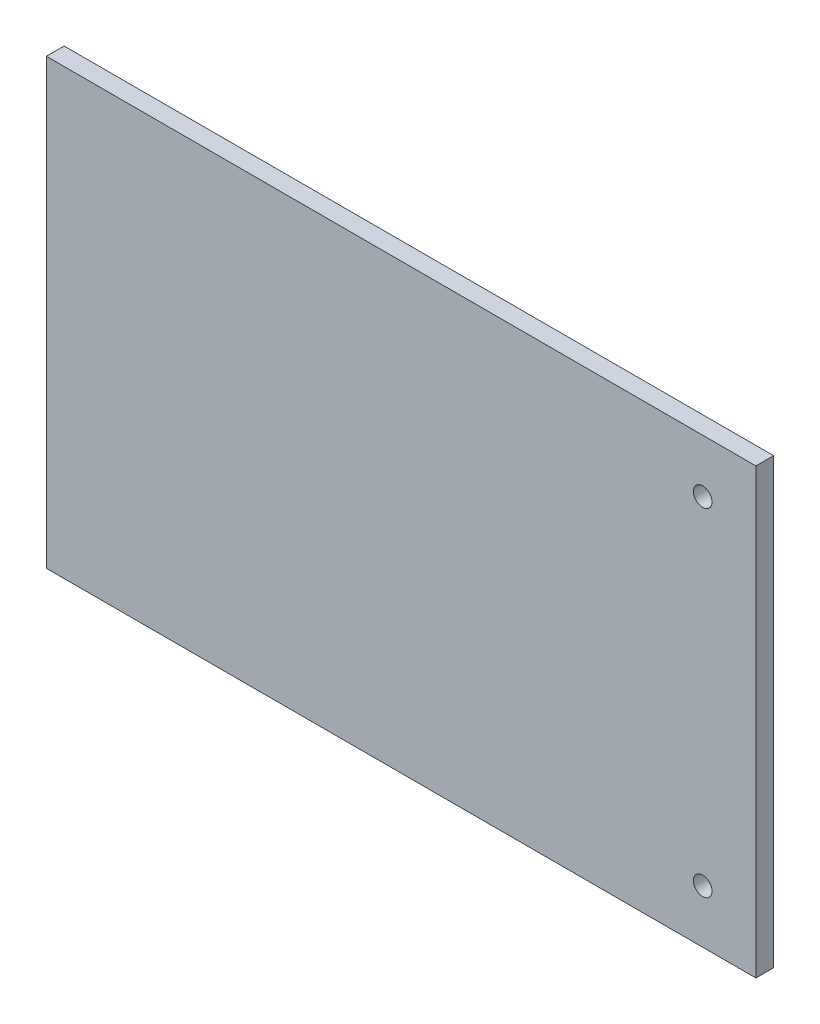
ISO-10303-21;
HEADER;
FILE_DESCRIPTION(('STEP AP214'),'2;1');
FILE_NAME('part.step','',(''),(''),'','','');
FILE_SCHEMA(('AUTOMOTIVE_DESIGN { 1 0 10303 214 1 1 1 1 }'));
ENDSEC;
DATA;
#1=APPLICATION_CONTEXT('core data for automotive mechanical design processes');
#2=APPLICATION_PROTOCOL_DEFINITION('international standard','automotive_design',2000,#1);
#3=PRODUCT_CONTEXT('',#1,'mechanical');
#4=PRODUCT('Part','Part','',(#3));
#5=PRODUCT_RELATED_PRODUCT_CATEGORY('part','',(#4));
#6=PRODUCT_DEFINITION_FORMATION('','',#4);
#7=PRODUCT_DEFINITION_CONTEXT('part definition',#1,'design');
#8=PRODUCT_DEFINITION('design','',#6,#7);
#9=PRODUCT_DEFINITION_SHAPE('','',#8);
#10=(LENGTH_UNIT() NAMED_UNIT(*) SI_UNIT(.MILLI.,.METRE.));
#11=(NAMED_UNIT(*) PLANE_ANGLE_UNIT() SI_UNIT($,.RADIAN.));
#12=(NAMED_UNIT(*) SI_UNIT($,.STERADIAN.) SOLID_ANGLE_UNIT());
#13=UNCERTAINTY_MEASURE_WITH_UNIT(LENGTH_MEASURE(1.E-05),#10,'distance_accuracy_value','');
#14=(GEOMETRIC_REPRESENTATION_CONTEXT(3) GLOBAL_UNCERTAINTY_ASSIGNED_CONTEXT((#13)) GLOBAL_UNIT_ASSIGNED_CONTEXT((#10,
#11,#12)) REPRESENTATION_CONTEXT('',''));
#15=CARTESIAN_POINT('',(0.,0.,0.));
#16=DIRECTION('',(0.,0.,1.));
#17=DIRECTION('',(1.,0.,0.));
#18=AXIS2_PLACEMENT_3D('',#15,#16,#17);
#19=CARTESIAN_POINT('',(-200.,125.,10.));
#20=DIRECTION('',(1.,0.,0.));
#21=DIRECTION('',(0.,1.,0.));
#22=AXIS2_PLACEMENT_3D('',#19,#20,#21);
#23=PLANE('',#22);
#24=DIRECTION('',(0.,-1.,0.));
#25=VECTOR('',#24,1.);
#26=CARTESIAN_POINT('',(-200.,125.,0.));
#27=LINE('',#26,#25);
#28=CARTESIAN_POINT('',(-200.,125.,0.));
#29=VERTEX_POINT('',#28);
#30=CARTESIAN_POINT('',(-200.,-125.,0.));
#31=VERTEX_POINT('',#30);
#32=EDGE_CURVE('E106',#29,#31,#27,.T.);
#33=ORIENTED_EDGE('',*,*,#32,.T.);
#34=DIRECTION('',(0.,0.,-1.));
#35=VECTOR('',#34,1.);
#36=CARTESIAN_POINT('',(-200.,-125.,10.));
#37=LINE('',#36,#35);
#38=CARTESIAN_POINT('',(-200.,-125.,10.));
#39=VERTEX_POINT('',#38);
#40=EDGE_CURVE('E11',#39,#31,#37,.T.);
#41=ORIENTED_EDGE('',*,*,#40,.F.);
#42=DIRECTION('',(0.,-1.,0.));
#43=VECTOR('',#42,1.);
#44=CARTESIAN_POINT('',(-200.,125.,10.));
#45=LINE('',#44,#43);
#46=CARTESIAN_POINT('',(-200.,125.,10.));
#47=VERTEX_POINT('',#46);
#48=EDGE_CURVE('E90',#47,#39,#45,.T.);
#49=ORIENTED_EDGE('',*,*,#48,.F.);
#50=DIRECTION('',(0.,0.,-1.));
#51=VECTOR('',#50,1.);
#52=CARTESIAN_POINT('',(-200.,125.,10.));
#53=LINE('',#52,#51);
#54=EDGE_CURVE('E102',#47,#29,#53,.T.);
#55=ORIENTED_EDGE('',*,*,#54,.T.);
#56=EDGE_LOOP('',(#33,#41,#49,#55));
#57=FACE_BOUND('',#56,.T.);
#58=ADVANCED_FACE('F38',(#57),#23,.F.);
#59=CARTESIAN_POINT('',(200.,-125.,10.));
#60=DIRECTION('',(0.,1.,0.));
#61=DIRECTION('',(-1.,0.,0.));
#62=AXIS2_PLACEMENT_3D('',#59,#60,#61);
#63=PLANE('',#62);
#64=DIRECTION('',(1.,0.,0.));
#65=VECTOR('',#64,1.);
#66=CARTESIAN_POINT('',(200.,-125.,0.));
#67=LINE('',#66,#65);
#68=CARTESIAN_POINT('',(200.,-125.,0.));
#69=VERTEX_POINT('',#68);
#70=EDGE_CURVE('E95',#31,#69,#67,.T.);
#71=ORIENTED_EDGE('',*,*,#70,.T.);
#72=DIRECTION('',(0.,0.,-1.));
#73=VECTOR('',#72,1.);
#74=CARTESIAN_POINT('',(200.,-125.,10.));
#75=LINE('',#74,#73);
#76=CARTESIAN_POINT('',(200.,-125.,10.));
#77=VERTEX_POINT('',#76);
#78=EDGE_CURVE('E47',#77,#69,#75,.T.);
#79=ORIENTED_EDGE('',*,*,#78,.F.);
#80=DIRECTION('',(1.,0.,0.));
#81=VECTOR('',#80,1.);
#82=CARTESIAN_POINT('',(200.,-125.,10.));
#83=LINE('',#82,#81);
#84=EDGE_CURVE('E85',#39,#77,#83,.T.);
#85=ORIENTED_EDGE('',*,*,#84,.F.);
#86=ORIENTED_EDGE('',*,*,#40,.T.);
#87=EDGE_LOOP('',(#71,#79,#85,#86));
#88=FACE_BOUND('',#87,.T.);
#89=ADVANCED_FACE('F94',(#88),#63,.F.);
#90=CARTESIAN_POINT('',(200.,125.,10.));
#91=DIRECTION('',(-1.,0.,0.));
#92=DIRECTION('',(0.,0.,1.));
#93=AXIS2_PLACEMENT_3D('',#90,#91,#92);
#94=PLANE('',#93);
#95=DIRECTION('',(0.,1.,0.));
#96=VECTOR('',#95,1.);
#97=CARTESIAN_POINT('',(200.,125.,0.));
#98=LINE('',#97,#96);
#99=CARTESIAN_POINT('',(200.,125.,0.));
#100=VERTEX_POINT('',#99);
#101=EDGE_CURVE('E72',#69,#100,#98,.T.);
#102=ORIENTED_EDGE('',*,*,#101,.T.);
#103=DIRECTION('',(0.,0.,-1.));
#104=VECTOR('',#103,1.);
#105=CARTESIAN_POINT('',(200.,125.,10.));
#106=LINE('',#105,#104);
#107=CARTESIAN_POINT('',(200.,125.,10.));
#108=VERTEX_POINT('',#107);
#109=EDGE_CURVE('E97',#108,#100,#106,.T.);
#110=ORIENTED_EDGE('',*,*,#109,.F.);
#111=DIRECTION('',(0.,1.,0.));
#112=VECTOR('',#111,1.);
#113=CARTESIAN_POINT('',(200.,125.,10.));
#114=LINE('',#113,#112);
#115=EDGE_CURVE('E88',#77,#108,#114,.T.);
#116=ORIENTED_EDGE('',*,*,#115,.F.);
#117=ORIENTED_EDGE('',*,*,#78,.T.);
#118=EDGE_LOOP('',(#102,#110,#116,#117));
#119=FACE_BOUND('',#118,.T.);
#120=ADVANCED_FACE('F98',(#119),#94,.F.);
#121=CARTESIAN_POINT('',(200.,125.,10.));
#122=DIRECTION('',(0.,-1.,0.));
#123=DIRECTION('',(1.,0.,0.));
#124=AXIS2_PLACEMENT_3D('',#121,#122,#123);
#125=PLANE('',#124);
#126=DIRECTION('',(-1.,0.,0.));
#127=VECTOR('',#126,1.);
#128=CARTESIAN_POINT('',(200.,125.,0.));
#129=LINE('',#128,#127);
#130=EDGE_CURVE('E78',#100,#29,#129,.T.);
#131=ORIENTED_EDGE('',*,*,#130,.T.);
#132=ORIENTED_EDGE('',*,*,#54,.F.);
#133=DIRECTION('',(-1.,0.,0.));
#134=VECTOR('',#133,1.);
#135=CARTESIAN_POINT('',(200.,125.,10.));
#136=LINE('',#135,#134);
#137=EDGE_CURVE('E55',#108,#47,#136,.T.);
#138=ORIENTED_EDGE('',*,*,#137,.F.);
#139=ORIENTED_EDGE('',*,*,#109,.T.);
#140=EDGE_LOOP('',(#131,#132,#138,#139));
#141=FACE_BOUND('',#140,.T.);
#142=ADVANCED_FACE('F120',(#141),#125,.F.);
#143=CARTESIAN_POINT('',(0.,0.,10.));
#144=DIRECTION('',(0.,0.,-1.));
#145=DIRECTION('',(-1.,0.,0.));
#146=AXIS2_PLACEMENT_3D('',#143,#144,#145);
#147=PLANE('',#146);
#148=CARTESIAN_POINT('',(170.,95.,10.));
#149=DIRECTION('',(0.,0.,1.));
#150=DIRECTION('',(1.,0.,0.));
#151=AXIS2_PLACEMENT_3D('',#148,#149,#150);
#152=CIRCLE('',#151,5.25);
#153=CARTESIAN_POINT('',(175.25,95.,10.));
#154=VERTEX_POINT('',#153);
#155=EDGE_CURVE('E138',#154,#154,#152,.T.);
#156=ORIENTED_EDGE('',*,*,#155,.F.);
#157=EDGE_LOOP('',(#156));
#158=FACE_BOUND('',#157,.T.);
#159=CARTESIAN_POINT('',(170.,-95.0000000000001,10.));
#160=DIRECTION('',(0.,0.,1.));
#161=DIRECTION('',(1.,0.,0.));
#162=AXIS2_PLACEMENT_3D('',#159,#160,#161);
#163=CIRCLE('',#162,5.25);
#164=CARTESIAN_POINT('',(175.25,-95.0000000000001,10.));
#165=VERTEX_POINT('',#164);
#166=EDGE_CURVE('E130',#165,#165,#163,.T.);
#167=ORIENTED_EDGE('',*,*,#166,.F.);
#168=EDGE_LOOP('',(#167));
#169=FACE_BOUND('',#168,.T.);
#170=ORIENTED_EDGE('',*,*,#48,.T.);
#171=ORIENTED_EDGE('',*,*,#84,.T.);
#172=ORIENTED_EDGE('',*,*,#115,.T.);
#173=ORIENTED_EDGE('',*,*,#137,.T.);
#174=EDGE_LOOP('',(#170,#171,#172,#173));
#175=FACE_BOUND('',#174,.T.);
#176=ADVANCED_FACE('F86',(#158,#169,#175),#147,.F.);
#177=CARTESIAN_POINT('',(0.,0.,0.));
#178=DIRECTION('',(0.,0.,-1.));
#179=DIRECTION('',(-1.,0.,0.));
#180=AXIS2_PLACEMENT_3D('',#177,#178,#179);
#181=PLANE('',#180);
#182=CARTESIAN_POINT('',(170.,95.,0.));
#183=DIRECTION('',(0.,0.,1.));
#184=DIRECTION('',(1.,0.,0.));
#185=AXIS2_PLACEMENT_3D('',#182,#183,#184);
#186=CIRCLE('',#185,5.25);
#187=CARTESIAN_POINT('',(175.25,95.,0.));
#188=VERTEX_POINT('',#187);
#189=EDGE_CURVE('E134',#188,#188,#186,.T.);
#190=ORIENTED_EDGE('',*,*,#189,.T.);
#191=EDGE_LOOP('',(#190));
#192=FACE_BOUND('',#191,.T.);
#193=CARTESIAN_POINT('',(170.,-95.0000000000001,0.));
#194=DIRECTION('',(0.,0.,1.));
#195=DIRECTION('',(1.,0.,0.));
#196=AXIS2_PLACEMENT_3D('',#193,#194,#195);
#197=CIRCLE('',#196,5.25);
#198=CARTESIAN_POINT('',(175.25,-95.0000000000001,0.));
#199=VERTEX_POINT('',#198);
#200=EDGE_CURVE('E110',#199,#199,#197,.T.);
#201=ORIENTED_EDGE('',*,*,#200,.T.);
#202=EDGE_LOOP('',(#201));
#203=FACE_BOUND('',#202,.T.);
#204=ORIENTED_EDGE('',*,*,#32,.F.);
#205=ORIENTED_EDGE('',*,*,#130,.F.);
#206=ORIENTED_EDGE('',*,*,#101,.F.);
#207=ORIENTED_EDGE('',*,*,#70,.F.);
#208=EDGE_LOOP('',(#204,#205,#206,#207));
#209=FACE_BOUND('',#208,.T.);
#210=ADVANCED_FACE('F123',(#192,#203,#209),#181,.T.);
#211=CARTESIAN_POINT('',(170.,-95.0000000000001,10.));
#212=DIRECTION('',(0.,0.,1.));
#213=DIRECTION('',(1.,0.,0.));
#214=AXIS2_PLACEMENT_3D('',#211,#212,#213);
#215=CYLINDRICAL_SURFACE('',#214,5.25);
#216=ORIENTED_EDGE('',*,*,#200,.F.);
#217=EDGE_LOOP('',(#216));
#218=FACE_BOUND('',#217,.T.);
#219=ORIENTED_EDGE('',*,*,#166,.T.);
#220=EDGE_LOOP('',(#219));
#221=FACE_BOUND('',#220,.T.);
#222=ADVANCED_FACE('F150',(#218,#221),#215,.F.);
#223=CARTESIAN_POINT('',(170.,95.,10.));
#224=DIRECTION('',(0.,0.,1.));
#225=DIRECTION('',(1.,0.,0.));
#226=AXIS2_PLACEMENT_3D('',#223,#224,#225);
#227=CYLINDRICAL_SURFACE('',#226,5.25);
#228=ORIENTED_EDGE('',*,*,#189,.F.);
#229=EDGE_LOOP('',(#228));
#230=FACE_BOUND('',#229,.T.);
#231=ORIENTED_EDGE('',*,*,#155,.T.);
#232=EDGE_LOOP('',(#231));
#233=FACE_BOUND('',#232,.T.);
#234=ADVANCED_FACE('F143',(#230,#233),#227,.F.);
#235=CLOSED_SHELL('',(#58,#89,#120,#142,#176,#210,#222,#234));
#236=MANIFOLD_SOLID_BREP('B2',#235);
#237=ADVANCED_BREP_SHAPE_REPRESENTATION('',(#18,#236),#14);
#238=SHAPE_DEFINITION_REPRESENTATION(#9,#237);
ENDSEC;
END-ISO-10303-21;
